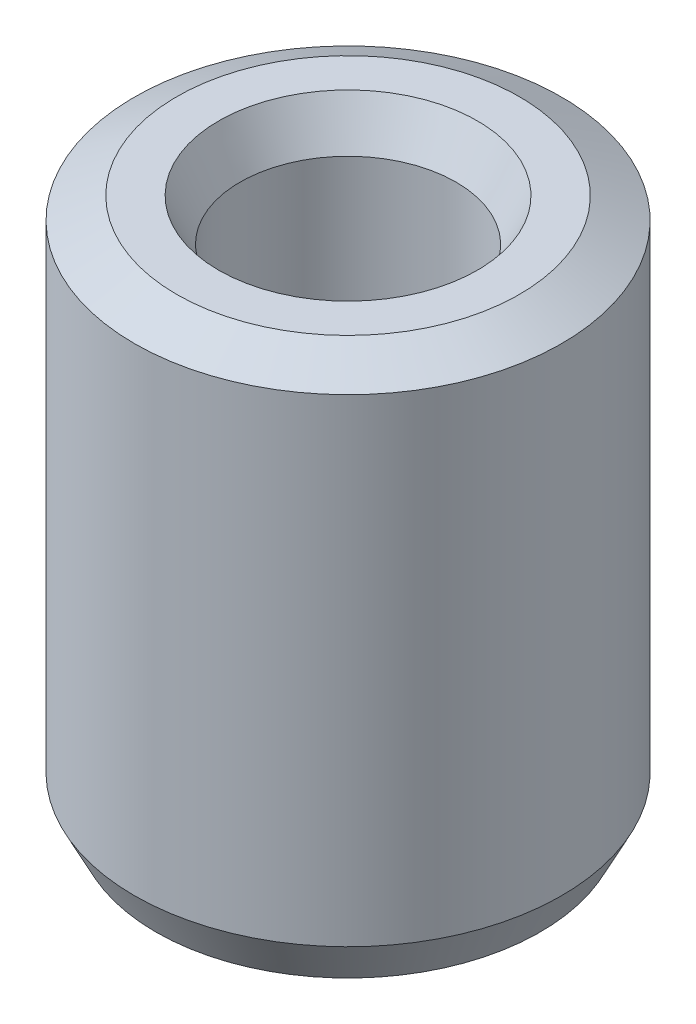
ISO-10303-21;
HEADER;
FILE_DESCRIPTION(('STEP AP214'),'2;1');
FILE_NAME('part.step','',(''),(''),'','','');
FILE_SCHEMA(('AUTOMOTIVE_DESIGN { 1 0 10303 214 1 1 1 1 }'));
ENDSEC;
DATA;
#1=APPLICATION_CONTEXT('core data for automotive mechanical design processes');
#2=APPLICATION_PROTOCOL_DEFINITION('international standard','automotive_design',2000,#1);
#3=PRODUCT_CONTEXT('',#1,'mechanical');
#4=PRODUCT('Part','Part','',(#3));
#5=PRODUCT_RELATED_PRODUCT_CATEGORY('part','',(#4));
#6=PRODUCT_DEFINITION_FORMATION('','',#4);
#7=PRODUCT_DEFINITION_CONTEXT('part definition',#1,'design');
#8=PRODUCT_DEFINITION('design','',#6,#7);
#9=PRODUCT_DEFINITION_SHAPE('','',#8);
#10=(LENGTH_UNIT() NAMED_UNIT(*) SI_UNIT(.MILLI.,.METRE.));
#11=(NAMED_UNIT(*) PLANE_ANGLE_UNIT() SI_UNIT($,.RADIAN.));
#12=(NAMED_UNIT(*) SI_UNIT($,.STERADIAN.) SOLID_ANGLE_UNIT());
#13=UNCERTAINTY_MEASURE_WITH_UNIT(LENGTH_MEASURE(1.E-05),#10,'distance_accuracy_value','');
#14=(GEOMETRIC_REPRESENTATION_CONTEXT(3) GLOBAL_UNCERTAINTY_ASSIGNED_CONTEXT((#13)) GLOBAL_UNIT_ASSIGNED_CONTEXT((#10,
#11,#12)) REPRESENTATION_CONTEXT('',''));
#15=CARTESIAN_POINT('',(0.,0.,0.));
#16=DIRECTION('',(0.,0.,1.));
#17=DIRECTION('',(1.,0.,0.));
#18=AXIS2_PLACEMENT_3D('',#15,#16,#17);
#19=CARTESIAN_POINT('',(0.,38.052163871248,0.));
#20=DIRECTION('',(0.,-1.,0.));
#21=DIRECTION('',(0.,0.,-1.));
#22=AXIS2_PLACEMENT_3D('',#19,#20,#21);
#23=CYLINDRICAL_SURFACE('',#22,15.);
#24=CARTESIAN_POINT('',(0.,2.96790270706598,0.));
#25=DIRECTION('',(0.,1.,0.));
#26=DIRECTION('',(0.,0.,1.));
#27=AXIS2_PLACEMENT_3D('',#24,#25,#26);
#28=CIRCLE('',#27,15.);
#29=CARTESIAN_POINT('',(0.,2.96790270706598,15.));
#30=VERTEX_POINT('',#29);
#31=EDGE_CURVE('E10',#30,#30,#28,.T.);
#32=ORIENTED_EDGE('',*,*,#31,.T.);
#33=EDGE_LOOP('',(#32));
#34=FACE_BOUND('',#33,.T.);
#35=CARTESIAN_POINT('',(0.,36.5458093838427,0.));
#36=DIRECTION('',(0.,1.,0.));
#37=DIRECTION('',(0.,0.,1.));
#38=AXIS2_PLACEMENT_3D('',#35,#36,#37);
#39=CIRCLE('',#38,15.);
#40=CARTESIAN_POINT('',(0.,36.5458093838427,15.));
#41=VERTEX_POINT('',#40);
#42=EDGE_CURVE('E50',#41,#41,#39,.F.);
#43=ORIENTED_EDGE('',*,*,#42,.T.);
#44=EDGE_LOOP('',(#43));
#45=FACE_BOUND('',#44,.T.);
#46=ADVANCED_FACE('F39',(#34,#45),#23,.T.);
#47=CARTESIAN_POINT('',(0.,38.052163871248,0.));
#48=DIRECTION('',(0.,1.,0.));
#49=DIRECTION('',(0.,0.,1.));
#50=AXIS2_PLACEMENT_3D('',#47,#48,#49);
#51=PLANE('',#50);
#52=CARTESIAN_POINT('',(0.,38.052163871248,0.));
#53=DIRECTION('',(0.,1.,0.));
#54=DIRECTION('',(0.,0.,1.));
#55=AXIS2_PLACEMENT_3D('',#52,#53,#54);
#56=CIRCLE('',#55,9.08590362946609);
#57=CARTESIAN_POINT('',(0.,38.052163871248,9.08590362946609));
#58=VERTEX_POINT('',#57);
#59=EDGE_CURVE('E58',#58,#58,#56,.F.);
#60=ORIENTED_EDGE('',*,*,#59,.T.);
#61=EDGE_LOOP('',(#60));
#62=FACE_BOUND('',#61,.T.);
#63=CARTESIAN_POINT('',(0.,38.052163871248,0.));
#64=DIRECTION('',(0.,1.,0.));
#65=DIRECTION('',(0.,0.,1.));
#66=AXIS2_PLACEMENT_3D('',#63,#64,#65);
#67=CIRCLE('',#66,12.032097292934);
#68=CARTESIAN_POINT('',(0.,38.052163871248,12.032097292934));
#69=VERTEX_POINT('',#68);
#70=EDGE_CURVE('E61',#69,#69,#67,.T.);
#71=ORIENTED_EDGE('',*,*,#70,.T.);
#72=EDGE_LOOP('',(#71));
#73=FACE_BOUND('',#72,.T.);
#74=ADVANCED_FACE('F88',(#62,#73),#51,.T.);
#75=CARTESIAN_POINT('',(0.,0.,0.));
#76=DIRECTION('',(0.,1.,0.));
#77=DIRECTION('',(0.,0.,1.));
#78=AXIS2_PLACEMENT_3D('',#75,#76,#77);
#79=PLANE('',#78);
#80=CARTESIAN_POINT('',(0.,0.,0.));
#81=DIRECTION('',(0.,1.,0.));
#82=DIRECTION('',(0.,0.,1.));
#83=AXIS2_PLACEMENT_3D('',#80,#81,#82);
#84=CIRCLE('',#83,10.5474518491267);
#85=CARTESIAN_POINT('',(0.,0.,10.5474518491267));
#86=VERTEX_POINT('',#85);
#87=EDGE_CURVE('E51',#86,#86,#84,.T.);
#88=ORIENTED_EDGE('',*,*,#87,.T.);
#89=EDGE_LOOP('',(#88));
#90=FACE_BOUND('',#89,.T.);
#91=CARTESIAN_POINT('',(0.,0.,0.));
#92=DIRECTION('',(0.,1.,0.));
#93=DIRECTION('',(0.,0.,1.));
#94=AXIS2_PLACEMENT_3D('',#91,#92,#93);
#95=CIRCLE('',#94,13.4936455125946);
#96=CARTESIAN_POINT('',(0.,0.,13.4936455125946));
#97=VERTEX_POINT('',#96);
#98=EDGE_CURVE('E54',#97,#97,#95,.F.);
#99=ORIENTED_EDGE('',*,*,#98,.T.);
#100=EDGE_LOOP('',(#99));
#101=FACE_BOUND('',#100,.T.);
#102=ADVANCED_FACE('F83',(#90,#101),#79,.F.);
#103=CARTESIAN_POINT('',(0.,38.052163871248,0.));
#104=DIRECTION('',(0.,-1.,0.));
#105=DIRECTION('',(0.,0.,-1.));
#106=AXIS2_PLACEMENT_3D('',#103,#104,#105);
#107=CYLINDRICAL_SURFACE('',#106,7.57954914206074);
#108=CARTESIAN_POINT('',(0.,35.0842611641821,0.));
#109=DIRECTION('',(0.,1.,0.));
#110=DIRECTION('',(0.,0.,1.));
#111=AXIS2_PLACEMENT_3D('',#108,#109,#110);
#112=CIRCLE('',#111,7.57954914206074);
#113=CARTESIAN_POINT('',(0.,35.0842611641821,7.57954914206074));
#114=VERTEX_POINT('',#113);
#115=EDGE_CURVE('E67',#114,#114,#112,.T.);
#116=ORIENTED_EDGE('',*,*,#115,.T.);
#117=EDGE_LOOP('',(#116));
#118=FACE_BOUND('',#117,.T.);
#119=CARTESIAN_POINT('',(0.,1.50635448740537,0.));
#120=DIRECTION('',(0.,1.,0.));
#121=DIRECTION('',(0.,0.,1.));
#122=AXIS2_PLACEMENT_3D('',#119,#120,#121);
#123=CIRCLE('',#122,7.57954914206074);
#124=CARTESIAN_POINT('',(0.,1.50635448740537,7.57954914206074));
#125=VERTEX_POINT('',#124);
#126=EDGE_CURVE('E69',#125,#125,#123,.F.);
#127=ORIENTED_EDGE('',*,*,#126,.T.);
#128=EDGE_LOOP('',(#127));
#129=FACE_BOUND('',#128,.T.);
#130=ADVANCED_FACE('F71',(#118,#129),#107,.F.);
#131=CARTESIAN_POINT('',(0.,35.0842611641821,0.));
#132=DIRECTION('',(0.,1.,0.));
#133=DIRECTION('',(0.,0.,1.));
#134=AXIS2_PLACEMENT_3D('',#131,#132,#133);
#135=CONICAL_SURFACE('',#134,7.57954914206074,0.469668136236951);
#136=ORIENTED_EDGE('',*,*,#59,.F.);
#137=EDGE_LOOP('',(#136));
#138=FACE_BOUND('',#137,.T.);
#139=ORIENTED_EDGE('',*,*,#115,.F.);
#140=EDGE_LOOP('',(#139));
#141=FACE_BOUND('',#140,.T.);
#142=ADVANCED_FACE('F77',(#138,#141),#135,.F.);
#143=CARTESIAN_POINT('',(0.,0.,0.));
#144=DIRECTION('',(0.,-1.,0.));
#145=DIRECTION('',(0.,0.,-1.));
#146=AXIS2_PLACEMENT_3D('',#143,#144,#145);
#147=CONICAL_SURFACE('',#146,10.5474518491267,1.10112819055795);
#148=ORIENTED_EDGE('',*,*,#126,.F.);
#149=EDGE_LOOP('',(#148));
#150=FACE_BOUND('',#149,.T.);
#151=ORIENTED_EDGE('',*,*,#87,.F.);
#152=EDGE_LOOP('',(#151));
#153=FACE_BOUND('',#152,.T.);
#154=ADVANCED_FACE('F73',(#150,#153),#147,.F.);
#155=CARTESIAN_POINT('',(0.,2.96790270706598,0.));
#156=DIRECTION('',(0.,1.,0.));
#157=DIRECTION('',(0.,0.,1.));
#158=AXIS2_PLACEMENT_3D('',#155,#156,#157);
#159=CONICAL_SURFACE('',#158,15.,0.469668136236949);
#160=ORIENTED_EDGE('',*,*,#98,.F.);
#161=EDGE_LOOP('',(#160));
#162=FACE_BOUND('',#161,.T.);
#163=ORIENTED_EDGE('',*,*,#31,.F.);
#164=EDGE_LOOP('',(#163));
#165=FACE_BOUND('',#164,.T.);
#166=ADVANCED_FACE('F76',(#162,#165),#159,.T.);
#167=CARTESIAN_POINT('',(0.,38.052163871248,0.));
#168=DIRECTION('',(0.,-1.,0.));
#169=DIRECTION('',(0.,0.,-1.));
#170=AXIS2_PLACEMENT_3D('',#167,#168,#169);
#171=CONICAL_SURFACE('',#170,12.032097292934,1.10112819055795);
#172=ORIENTED_EDGE('',*,*,#42,.F.);
#173=EDGE_LOOP('',(#172));
#174=FACE_BOUND('',#173,.T.);
#175=ORIENTED_EDGE('',*,*,#70,.F.);
#176=EDGE_LOOP('',(#175));
#177=FACE_BOUND('',#176,.T.);
#178=ADVANCED_FACE('F45',(#174,#177),#171,.T.);
#179=CLOSED_SHELL('',(#46,#74,#102,#130,#142,#154,#166,#178));
#180=MANIFOLD_SOLID_BREP('B2',#179);
#181=ADVANCED_BREP_SHAPE_REPRESENTATION('',(#18,#180),#14);
#182=SHAPE_DEFINITION_REPRESENTATION(#9,#181);
ENDSEC;
END-ISO-10303-21;
